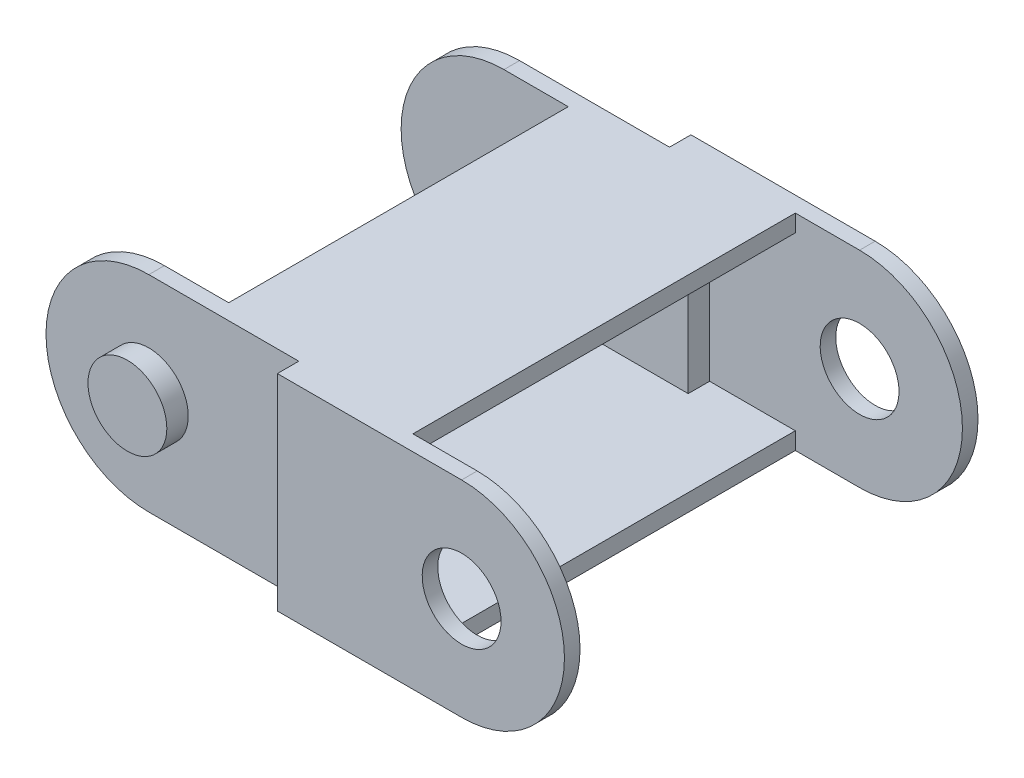
ISO-10303-21;
HEADER;
FILE_DESCRIPTION(('STEP AP214'),'2;1');
FILE_NAME('part.step','',(''),(''),'','','');
FILE_SCHEMA(('AUTOMOTIVE_DESIGN { 1 0 10303 214 1 1 1 1 }'));
ENDSEC;
DATA;
#1=APPLICATION_CONTEXT('core data for automotive mechanical design processes');
#2=APPLICATION_PROTOCOL_DEFINITION('international standard','automotive_design',2000,#1);
#3=PRODUCT_CONTEXT('',#1,'mechanical');
#4=PRODUCT('Part','Part','',(#3));
#5=PRODUCT_RELATED_PRODUCT_CATEGORY('part','',(#4));
#6=PRODUCT_DEFINITION_FORMATION('','',#4);
#7=PRODUCT_DEFINITION_CONTEXT('part definition',#1,'design');
#8=PRODUCT_DEFINITION('design','',#6,#7);
#9=PRODUCT_DEFINITION_SHAPE('','',#8);
#10=(LENGTH_UNIT() NAMED_UNIT(*) SI_UNIT(.MILLI.,.METRE.));
#11=(NAMED_UNIT(*) PLANE_ANGLE_UNIT() SI_UNIT($,.RADIAN.));
#12=(NAMED_UNIT(*) SI_UNIT($,.STERADIAN.) SOLID_ANGLE_UNIT());
#13=UNCERTAINTY_MEASURE_WITH_UNIT(LENGTH_MEASURE(1.E-05),#10,'distance_accuracy_value','');
#14=(GEOMETRIC_REPRESENTATION_CONTEXT(3) GLOBAL_UNCERTAINTY_ASSIGNED_CONTEXT((#13)) GLOBAL_UNIT_ASSIGNED_CONTEXT((#10,
#11,#12)) REPRESENTATION_CONTEXT('',''));
#15=CARTESIAN_POINT('',(0.,0.,0.));
#16=DIRECTION('',(0.,0.,1.));
#17=DIRECTION('',(1.,0.,0.));
#18=AXIS2_PLACEMENT_3D('',#15,#16,#17);
#19=CARTESIAN_POINT('',(-3.74999999999999,6.00000000000001,11.156));
#20=DIRECTION('',(-1.,0.,0.));
#21=DIRECTION('',(0.,0.,1.));
#22=AXIS2_PLACEMENT_3D('',#19,#20,#21);
#23=PLANE('',#22);
#24=DIRECTION('',(0.,0.,-1.));
#25=VECTOR('',#24,1.);
#26=CARTESIAN_POINT('',(-3.75,-5.,9.90600000000001));
#27=LINE('',#26,#25);
#28=CARTESIAN_POINT('',(-3.74999999999999,-5.00000000000003,11.156));
#29=VERTEX_POINT('',#28);
#30=CARTESIAN_POINT('',(-3.75,-5.,-11.156));
#31=VERTEX_POINT('',#30);
#32=EDGE_CURVE('E405',#29,#31,#27,.T.);
#33=ORIENTED_EDGE('',*,*,#32,.F.);
#34=DIRECTION('',(0.,-1.,0.));
#35=VECTOR('',#34,1.);
#36=CARTESIAN_POINT('',(-3.74999999999999,6.00000000000001,11.156));
#37=LINE('',#36,#35);
#38=CARTESIAN_POINT('',(-3.75,-6.00000000000001,11.156));
#39=VERTEX_POINT('',#38);
#40=EDGE_CURVE('E261',#29,#39,#37,.T.);
#41=ORIENTED_EDGE('',*,*,#40,.T.);
#42=DIRECTION('',(0.,0.,-1.));
#43=VECTOR('',#42,1.);
#44=CARTESIAN_POINT('',(-3.75,-6.00000000000001,11.156));
#45=LINE('',#44,#43);
#46=CARTESIAN_POINT('',(-3.75,-6.00000000000001,-11.156));
#47=VERTEX_POINT('',#46);
#48=EDGE_CURVE('E248',#39,#47,#45,.T.);
#49=ORIENTED_EDGE('',*,*,#48,.T.);
#50=DIRECTION('',(0.,-1.,0.));
#51=VECTOR('',#50,1.);
#52=CARTESIAN_POINT('',(-3.74999999999999,6.00000000000001,-11.156));
#53=LINE('',#52,#51);
#54=EDGE_CURVE('E247',#31,#47,#53,.T.);
#55=ORIENTED_EDGE('',*,*,#54,.F.);
#56=EDGE_LOOP('',(#33,#41,#49,#55));
#57=FACE_BOUND('',#56,.T.);
#58=ADVANCED_FACE('F32',(#57),#23,.F.);
#59=CARTESIAN_POINT('',(-25.5,6.00000000000001,-9.906));
#60=DIRECTION('',(0.,0.,-1.));
#61=DIRECTION('',(-1.,0.,0.));
#62=AXIS2_PLACEMENT_3D('',#59,#60,#61);
#63=PLANE('',#62);
#64=DIRECTION('',(0.,-1.,0.));
#65=VECTOR('',#64,1.);
#66=CARTESIAN_POINT('',(-8.75000000000001,5.,-9.90599999999998));
#67=LINE('',#66,#65);
#68=CARTESIAN_POINT('',(-8.75000000000001,5.,-9.90599999999998));
#69=VERTEX_POINT('',#68);
#70=CARTESIAN_POINT('',(-8.74999999999999,-5.00000000000002,-9.906));
#71=VERTEX_POINT('',#70);
#72=EDGE_CURVE('E47',#69,#71,#67,.T.);
#73=ORIENTED_EDGE('',*,*,#72,.F.);
#74=DIRECTION('',(1.,0.,0.));
#75=VECTOR('',#74,1.);
#76=CARTESIAN_POINT('',(-25.5,5.,-9.90599999999998));
#77=LINE('',#76,#75);
#78=CARTESIAN_POINT('',(-15.75,5.,-9.90599999999998));
#79=VERTEX_POINT('',#78);
#80=EDGE_CURVE('E221',#79,#69,#77,.T.);
#81=ORIENTED_EDGE('',*,*,#80,.F.);
#82=DIRECTION('',(0.,-1.,0.));
#83=VECTOR('',#82,1.);
#84=CARTESIAN_POINT('',(-15.75,6.00000000000001,-9.906));
#85=LINE('',#84,#83);
#86=CARTESIAN_POINT('',(-15.75,6.00000000000001,-9.906));
#87=VERTEX_POINT('',#86);
#88=EDGE_CURVE('E283',#87,#79,#85,.T.);
#89=ORIENTED_EDGE('',*,*,#88,.F.);
#90=DIRECTION('',(1.,0.,0.));
#91=VECTOR('',#90,1.);
#92=CARTESIAN_POINT('',(-25.5,6.00000000000001,-9.906));
#93=LINE('',#92,#91);
#94=CARTESIAN_POINT('',(-19.5,6.00000000000001,-9.906));
#95=VERTEX_POINT('',#94);
#96=EDGE_CURVE('E265',#95,#87,#93,.T.);
#97=ORIENTED_EDGE('',*,*,#96,.F.);
#98=CARTESIAN_POINT('',(-19.5,0.,-9.906));
#99=DIRECTION('',(0.,0.,-1.));
#100=DIRECTION('',(-1.,0.,0.));
#101=AXIS2_PLACEMENT_3D('',#98,#99,#100);
#102=CIRCLE('',#101,6.);
#103=CARTESIAN_POINT('',(-19.5,-5.99999999999999,-9.90599999999999));
#104=VERTEX_POINT('',#103);
#105=EDGE_CURVE('E323',#104,#95,#102,.T.);
#106=ORIENTED_EDGE('',*,*,#105,.F.);
#107=DIRECTION('',(-1.,0.,0.));
#108=VECTOR('',#107,1.);
#109=CARTESIAN_POINT('',(0.,-5.99999999999999,-9.906));
#110=LINE('',#109,#108);
#111=CARTESIAN_POINT('',(-15.75,-6.00000000000006,-9.906));
#112=VERTEX_POINT('',#111);
#113=EDGE_CURVE('E373',#112,#104,#110,.T.);
#114=ORIENTED_EDGE('',*,*,#113,.F.);
#115=CARTESIAN_POINT('',(-15.75,-5.,-9.906));
#116=VERTEX_POINT('',#115);
#117=EDGE_CURVE('E275',#116,#112,#85,.T.);
#118=ORIENTED_EDGE('',*,*,#117,.F.);
#119=DIRECTION('',(1.,0.,0.));
#120=VECTOR('',#119,1.);
#121=CARTESIAN_POINT('',(-25.5,-5.,-9.906));
#122=LINE('',#121,#120);
#123=EDGE_CURVE('E54',#116,#71,#122,.T.);
#124=ORIENTED_EDGE('',*,*,#123,.T.);
#125=EDGE_LOOP('',(#73,#81,#89,#97,#106,#114,#118,#124));
#126=FACE_BOUND('',#125,.T.);
#127=ADVANCED_FACE('F387',(#126),#63,.F.);
#128=CARTESIAN_POINT('',(-15.75,6.00000000000001,9.906));
#129=DIRECTION('',(1.,0.,0.));
#130=DIRECTION('',(0.,1.,0.));
#131=AXIS2_PLACEMENT_3D('',#128,#129,#130);
#132=PLANE('',#131);
#133=ORIENTED_EDGE('',*,*,#88,.T.);
#134=DIRECTION('',(0.,0.,1.));
#135=VECTOR('',#134,1.);
#136=CARTESIAN_POINT('',(-15.75,4.99999999999999,9.906));
#137=LINE('',#136,#135);
#138=CARTESIAN_POINT('',(-15.75,4.99999999999999,9.906));
#139=VERTEX_POINT('',#138);
#140=EDGE_CURVE('E11',#79,#139,#137,.T.);
#141=ORIENTED_EDGE('',*,*,#140,.T.);
#142=DIRECTION('',(0.,-1.,0.));
#143=VECTOR('',#142,1.);
#144=CARTESIAN_POINT('',(-15.75,6.00000000000001,9.906));
#145=LINE('',#144,#143);
#146=CARTESIAN_POINT('',(-15.75,6.00000000000001,9.906));
#147=VERTEX_POINT('',#146);
#148=EDGE_CURVE('E219',#147,#139,#145,.T.);
#149=ORIENTED_EDGE('',*,*,#148,.F.);
#150=DIRECTION('',(0.,0.,1.));
#151=VECTOR('',#150,1.);
#152=CARTESIAN_POINT('',(-15.75,6.00000000000001,9.906));
#153=LINE('',#152,#151);
#154=EDGE_CURVE('E268',#87,#147,#153,.T.);
#155=ORIENTED_EDGE('',*,*,#154,.F.);
#156=EDGE_LOOP('',(#133,#141,#149,#155));
#157=FACE_BOUND('',#156,.T.);
#158=ADVANCED_FACE('F473',(#157),#132,.F.);
#159=CARTESIAN_POINT('',(0.,0.,12.065));
#160=DIRECTION('',(0.,0.,-1.));
#161=DIRECTION('',(-1.,0.,0.));
#162=AXIS2_PLACEMENT_3D('',#159,#160,#161);
#163=CYLINDRICAL_SURFACE('',#162,6.);
#164=DIRECTION('',(0.,0.,-1.));
#165=VECTOR('',#164,1.);
#166=CARTESIAN_POINT('',(0.,-6.00000000000001,12.065));
#167=LINE('',#166,#165);
#168=CARTESIAN_POINT('',(0.,-6.00000000000001,12.065));
#169=VERTEX_POINT('',#168);
#170=CARTESIAN_POINT('',(0.,-6.00000000000001,11.156));
#171=VERTEX_POINT('',#170);
#172=EDGE_CURVE('E351',#169,#171,#167,.T.);
#173=ORIENTED_EDGE('',*,*,#172,.T.);
#174=CARTESIAN_POINT('',(0.,0.,11.156));
#175=DIRECTION('',(0.,0.,1.));
#176=DIRECTION('',(0.,-1.,0.));
#177=AXIS2_PLACEMENT_3D('',#174,#175,#176);
#178=CIRCLE('',#177,6.);
#179=CARTESIAN_POINT('',(0.,5.99999999999999,11.156));
#180=VERTEX_POINT('',#179);
#181=EDGE_CURVE('E317',#171,#180,#178,.T.);
#182=ORIENTED_EDGE('',*,*,#181,.T.);
#183=DIRECTION('',(0.,0.,-1.));
#184=VECTOR('',#183,1.);
#185=CARTESIAN_POINT('',(0.,5.99999999999999,12.065));
#186=LINE('',#185,#184);
#187=CARTESIAN_POINT('',(0.,5.99999999999999,12.065));
#188=VERTEX_POINT('',#187);
#189=EDGE_CURVE('E362',#188,#180,#186,.T.);
#190=ORIENTED_EDGE('',*,*,#189,.F.);
#191=CARTESIAN_POINT('',(0.,0.,12.065));
#192=DIRECTION('',(0.,0.,1.));
#193=DIRECTION('',(1.,0.,0.));
#194=AXIS2_PLACEMENT_3D('',#191,#192,#193);
#195=CIRCLE('',#194,6.);
#196=EDGE_CURVE('E334',#169,#188,#195,.T.);
#197=ORIENTED_EDGE('',*,*,#196,.F.);
#198=EDGE_LOOP('',(#173,#182,#190,#197));
#199=FACE_BOUND('',#198,.T.);
#200=ADVANCED_FACE('F436',(#199),#163,.T.);
#201=CARTESIAN_POINT('',(-19.5,0.,12.065));
#202=DIRECTION('',(0.,0.,-1.));
#203=DIRECTION('',(-1.,0.,0.));
#204=AXIS2_PLACEMENT_3D('',#201,#202,#203);
#205=CYLINDRICAL_SURFACE('',#204,6.);
#206=DIRECTION('',(0.,0.,-1.));
#207=VECTOR('',#206,1.);
#208=CARTESIAN_POINT('',(-19.5,5.99999999999998,12.065));
#209=LINE('',#208,#207);
#210=CARTESIAN_POINT('',(-19.5,6.00000000000001,10.815));
#211=VERTEX_POINT('',#210);
#212=CARTESIAN_POINT('',(-19.5,6.00000000000001,9.906));
#213=VERTEX_POINT('',#212);
#214=EDGE_CURVE('E361',#211,#213,#209,.T.);
#215=ORIENTED_EDGE('',*,*,#214,.T.);
#216=CARTESIAN_POINT('',(-19.5,0.,9.906));
#217=DIRECTION('',(0.,0.,1.));
#218=DIRECTION('',(1.,0.,0.));
#219=AXIS2_PLACEMENT_3D('',#216,#217,#218);
#220=CIRCLE('',#219,6.);
#221=CARTESIAN_POINT('',(-19.5,-5.99999999999999,9.906));
#222=VERTEX_POINT('',#221);
#223=EDGE_CURVE('E325',#213,#222,#220,.T.);
#224=ORIENTED_EDGE('',*,*,#223,.T.);
#225=DIRECTION('',(0.,0.,-1.));
#226=VECTOR('',#225,1.);
#227=CARTESIAN_POINT('',(-19.5,-5.99999999999999,12.065));
#228=LINE('',#227,#226);
#229=CARTESIAN_POINT('',(-19.5,-5.99999999999999,10.815));
#230=VERTEX_POINT('',#229);
#231=EDGE_CURVE('E357',#230,#222,#228,.T.);
#232=ORIENTED_EDGE('',*,*,#231,.F.);
#233=CARTESIAN_POINT('',(-19.5,0.,10.815));
#234=DIRECTION('',(0.,0.,-1.));
#235=DIRECTION('',(-1.,0.,0.));
#236=AXIS2_PLACEMENT_3D('',#233,#234,#235);
#237=CIRCLE('',#236,6.);
#238=EDGE_CURVE('E319',#230,#211,#237,.T.);
#239=ORIENTED_EDGE('',*,*,#238,.T.);
#240=EDGE_LOOP('',(#215,#224,#232,#239));
#241=FACE_BOUND('',#240,.T.);
#242=ADVANCED_FACE('F450',(#241),#205,.T.);
#243=CARTESIAN_POINT('',(0.,0.,12.065));
#244=DIRECTION('',(0.,0.,-1.));
#245=DIRECTION('',(-1.,0.,0.));
#246=AXIS2_PLACEMENT_3D('',#243,#244,#245);
#247=CYLINDRICAL_SURFACE('',#246,2.2999954);
#248=CARTESIAN_POINT('',(0.,0.,11.156));
#249=DIRECTION('',(0.,0.,1.));
#250=DIRECTION('',(0.,-1.,0.));
#251=AXIS2_PLACEMENT_3D('',#248,#249,#250);
#252=CIRCLE('',#251,2.2999954);
#253=CARTESIAN_POINT('',(0.,-2.2999954,11.156));
#254=VERTEX_POINT('',#253);
#255=EDGE_CURVE('E316',#254,#254,#252,.T.);
#256=ORIENTED_EDGE('',*,*,#255,.F.);
#257=EDGE_LOOP('',(#256));
#258=FACE_BOUND('',#257,.T.);
#259=CARTESIAN_POINT('',(0.,0.,12.065));
#260=DIRECTION('',(0.,0.,1.));
#261=DIRECTION('',(1.,0.,0.));
#262=AXIS2_PLACEMENT_3D('',#259,#260,#261);
#263=CIRCLE('',#262,2.2999954);
#264=CARTESIAN_POINT('',(2.2999954,0.,12.065));
#265=VERTEX_POINT('',#264);
#266=EDGE_CURVE('E328',#265,#265,#263,.T.);
#267=ORIENTED_EDGE('',*,*,#266,.T.);
#268=EDGE_LOOP('',(#267));
#269=FACE_BOUND('',#268,.T.);
#270=ADVANCED_FACE('F620',(#258,#269),#247,.F.);
#271=CARTESIAN_POINT('',(0.,0.,12.065));
#272=DIRECTION('',(0.,0.,1.));
#273=DIRECTION('',(1.,0.,0.));
#274=AXIS2_PLACEMENT_3D('',#271,#272,#273);
#275=PLANE('',#274);
#276=DIRECTION('',(0.,-1.,0.));
#277=VECTOR('',#276,1.);
#278=CARTESIAN_POINT('',(-10.75,6.00000000000001,12.065));
#279=LINE('',#278,#277);
#280=CARTESIAN_POINT('',(-10.75,6.00000000000001,12.065));
#281=VERTEX_POINT('',#280);
#282=CARTESIAN_POINT('',(-10.75,-6.00000000000001,12.065));
#283=VERTEX_POINT('',#282);
#284=EDGE_CURVE('E293',#281,#283,#279,.T.);
#285=ORIENTED_EDGE('',*,*,#284,.T.);
#286=DIRECTION('',(1.,0.,0.));
#287=VECTOR('',#286,1.);
#288=CARTESIAN_POINT('',(0.,-6.00000000000001,12.065));
#289=LINE('',#288,#287);
#290=EDGE_CURVE('E341',#283,#169,#289,.T.);
#291=ORIENTED_EDGE('',*,*,#290,.T.);
#292=ORIENTED_EDGE('',*,*,#196,.T.);
#293=DIRECTION('',(-1.,0.,0.));
#294=VECTOR('',#293,1.);
#295=CARTESIAN_POINT('',(0.,5.99999999999999,12.065));
#296=LINE('',#295,#294);
#297=EDGE_CURVE('E337',#188,#281,#296,.T.);
#298=ORIENTED_EDGE('',*,*,#297,.T.);
#299=EDGE_LOOP('',(#285,#291,#292,#298));
#300=FACE_BOUND('',#299,.T.);
#301=ORIENTED_EDGE('',*,*,#266,.F.);
#302=EDGE_LOOP('',(#301));
#303=FACE_BOUND('',#302,.T.);
#304=ADVANCED_FACE('F438',(#300,#303),#275,.T.);
#305=CARTESIAN_POINT('',(0.,0.,-12.065));
#306=DIRECTION('',(0.,0.,1.));
#307=DIRECTION('',(1.,0.,0.));
#308=AXIS2_PLACEMENT_3D('',#305,#306,#307);
#309=PLANE('',#308);
#310=DIRECTION('',(1.,0.,0.));
#311=VECTOR('',#310,1.);
#312=CARTESIAN_POINT('',(0.,-6.00000000000001,-12.065));
#313=LINE('',#312,#311);
#314=CARTESIAN_POINT('',(-10.75,-6.00000000000001,-12.065));
#315=VERTEX_POINT('',#314);
#316=CARTESIAN_POINT('',(0.,-6.00000000000001,-12.065));
#317=VERTEX_POINT('',#316);
#318=EDGE_CURVE('E338',#315,#317,#313,.T.);
#319=ORIENTED_EDGE('',*,*,#318,.F.);
#320=DIRECTION('',(0.,-1.,0.));
#321=VECTOR('',#320,1.);
#322=CARTESIAN_POINT('',(-10.75,6.00000000000001,-12.065));
#323=LINE('',#322,#321);
#324=CARTESIAN_POINT('',(-10.75,6.00000000000001,-12.065));
#325=VERTEX_POINT('',#324);
#326=EDGE_CURVE('E307',#325,#315,#323,.T.);
#327=ORIENTED_EDGE('',*,*,#326,.F.);
#328=DIRECTION('',(-1.,0.,0.));
#329=VECTOR('',#328,1.);
#330=CARTESIAN_POINT('',(0.,5.99999999999999,-12.065));
#331=LINE('',#330,#329);
#332=CARTESIAN_POINT('',(0.,5.99999999999999,-12.065));
#333=VERTEX_POINT('',#332);
#334=EDGE_CURVE('E346',#333,#325,#331,.T.);
#335=ORIENTED_EDGE('',*,*,#334,.F.);
#336=CARTESIAN_POINT('',(0.,0.,-12.065));
#337=DIRECTION('',(0.,0.,1.));
#338=DIRECTION('',(1.,0.,0.));
#339=AXIS2_PLACEMENT_3D('',#336,#337,#338);
#340=CIRCLE('',#339,6.);
#341=EDGE_CURVE('E331',#317,#333,#340,.T.);
#342=ORIENTED_EDGE('',*,*,#341,.F.);
#343=EDGE_LOOP('',(#319,#327,#335,#342));
#344=FACE_BOUND('',#343,.T.);
#345=CARTESIAN_POINT('',(0.,0.,-12.065));
#346=DIRECTION('',(0.,0.,1.));
#347=DIRECTION('',(1.,0.,0.));
#348=AXIS2_PLACEMENT_3D('',#345,#346,#347);
#349=CIRCLE('',#348,2.2999954);
#350=CARTESIAN_POINT('',(2.2999954,0.,-12.065));
#351=VERTEX_POINT('',#350);
#352=EDGE_CURVE('E327',#351,#351,#349,.T.);
#353=ORIENTED_EDGE('',*,*,#352,.T.);
#354=EDGE_LOOP('',(#353));
#355=FACE_BOUND('',#354,.T.);
#356=ADVANCED_FACE('F458',(#344,#355),#309,.F.);
#357=CARTESIAN_POINT('',(0.,5.99999999999999,-11.156));
#358=VERTEX_POINT('',#357);
#359=EDGE_CURVE('E366',#358,#333,#186,.T.);
#360=ORIENTED_EDGE('',*,*,#359,.F.);
#361=CARTESIAN_POINT('',(0.,0.,-11.156));
#362=DIRECTION('',(0.,0.,-1.));
#363=DIRECTION('',(0.,1.,0.));
#364=AXIS2_PLACEMENT_3D('',#361,#362,#363);
#365=CIRCLE('',#364,6.);
#366=CARTESIAN_POINT('',(0.,-6.00000000000001,-11.156));
#367=VERTEX_POINT('',#366);
#368=EDGE_CURVE('E314',#358,#367,#365,.T.);
#369=ORIENTED_EDGE('',*,*,#368,.T.);
#370=EDGE_CURVE('E343',#367,#317,#167,.T.);
#371=ORIENTED_EDGE('',*,*,#370,.T.);
#372=ORIENTED_EDGE('',*,*,#341,.T.);
#373=EDGE_LOOP('',(#360,#369,#371,#372));
#374=FACE_BOUND('',#373,.T.);
#375=ADVANCED_FACE('F34',(#374),#163,.T.);
#376=CARTESIAN_POINT('',(0.,5.99999999999999,12.065));
#377=DIRECTION('',(0.,-1.,0.));
#378=DIRECTION('',(1.,0.,0.));
#379=AXIS2_PLACEMENT_3D('',#376,#377,#378);
#380=PLANE('',#379);
#381=ORIENTED_EDGE('',*,*,#189,.T.);
#382=DIRECTION('',(-1.,0.,0.));
#383=VECTOR('',#382,1.);
#384=CARTESIAN_POINT('',(-3.74999999999999,6.00000000000001,11.156));
#385=LINE('',#384,#383);
#386=CARTESIAN_POINT('',(-3.74999999999999,6.00000000000001,11.156));
#387=VERTEX_POINT('',#386);
#388=EDGE_CURVE('E244',#180,#387,#385,.T.);
#389=ORIENTED_EDGE('',*,*,#388,.T.);
#390=DIRECTION('',(0.,0.,-1.));
#391=VECTOR('',#390,1.);
#392=CARTESIAN_POINT('',(-3.74999999999999,6.00000000000001,11.156));
#393=LINE('',#392,#391);
#394=CARTESIAN_POINT('',(-3.74999999999999,6.00000000000001,-11.156));
#395=VERTEX_POINT('',#394);
#396=EDGE_CURVE('E237',#387,#395,#393,.T.);
#397=ORIENTED_EDGE('',*,*,#396,.T.);
#398=DIRECTION('',(1.,0.,0.));
#399=VECTOR('',#398,1.);
#400=CARTESIAN_POINT('',(-3.74999999999999,6.00000000000001,-11.156));
#401=LINE('',#400,#399);
#402=EDGE_CURVE('E240',#395,#358,#401,.T.);
#403=ORIENTED_EDGE('',*,*,#402,.T.);
#404=ORIENTED_EDGE('',*,*,#359,.T.);
#405=ORIENTED_EDGE('',*,*,#334,.T.);
#406=DIRECTION('',(0.,0.,1.));
#407=VECTOR('',#406,1.);
#408=CARTESIAN_POINT('',(-10.75,6.00000000000001,-10.815));
#409=LINE('',#408,#407);
#410=CARTESIAN_POINT('',(-10.75,6.00000000000001,-10.815));
#411=VERTEX_POINT('',#410);
#412=EDGE_CURVE('E300',#325,#411,#409,.T.);
#413=ORIENTED_EDGE('',*,*,#412,.T.);
#414=DIRECTION('',(-1.,0.,0.));
#415=VECTOR('',#414,1.);
#416=CARTESIAN_POINT('',(-25.5,6.00000000000001,-10.815));
#417=LINE('',#416,#415);
#418=CARTESIAN_POINT('',(-19.5,6.00000000000001,-10.815));
#419=VERTEX_POINT('',#418);
#420=EDGE_CURVE('E303',#411,#419,#417,.T.);
#421=ORIENTED_EDGE('',*,*,#420,.T.);
#422=EDGE_CURVE('E358',#95,#419,#209,.T.);
#423=ORIENTED_EDGE('',*,*,#422,.F.);
#424=ORIENTED_EDGE('',*,*,#96,.T.);
#425=ORIENTED_EDGE('',*,*,#154,.T.);
#426=DIRECTION('',(-1.,0.,0.));
#427=VECTOR('',#426,1.);
#428=CARTESIAN_POINT('',(-25.5,6.00000000000001,9.906));
#429=LINE('',#428,#427);
#430=EDGE_CURVE('E272',#147,#213,#429,.T.);
#431=ORIENTED_EDGE('',*,*,#430,.T.);
#432=ORIENTED_EDGE('',*,*,#214,.F.);
#433=DIRECTION('',(1.,0.,0.));
#434=VECTOR('',#433,1.);
#435=CARTESIAN_POINT('',(-10.75,6.00000000000001,10.815));
#436=LINE('',#435,#434);
#437=CARTESIAN_POINT('',(-10.75,6.00000000000001,10.815));
#438=VERTEX_POINT('',#437);
#439=EDGE_CURVE('E289',#211,#438,#436,.T.);
#440=ORIENTED_EDGE('',*,*,#439,.T.);
#441=DIRECTION('',(0.,0.,1.));
#442=VECTOR('',#441,1.);
#443=CARTESIAN_POINT('',(-10.75,6.00000000000001,12.065));
#444=LINE('',#443,#442);
#445=EDGE_CURVE('E286',#438,#281,#444,.T.);
#446=ORIENTED_EDGE('',*,*,#445,.T.);
#447=ORIENTED_EDGE('',*,*,#297,.F.);
#448=EDGE_LOOP('',(#381,#389,#397,#403,#404,#405,#413,#421,#423,#424,#425,#431,#432,#440,#446,#447));
#449=FACE_BOUND('',#448,.T.);
#450=ADVANCED_FACE('F428',(#449),#380,.F.);
#451=ORIENTED_EDGE('',*,*,#105,.T.);
#452=ORIENTED_EDGE('',*,*,#422,.T.);
#453=CARTESIAN_POINT('',(-19.5,0.,-10.815));
#454=DIRECTION('',(0.,0.,1.));
#455=DIRECTION('',(1.,0.,0.));
#456=AXIS2_PLACEMENT_3D('',#453,#454,#455);
#457=CIRCLE('',#456,6.);
#458=CARTESIAN_POINT('',(-19.5,-5.99999999999999,-10.815));
#459=VERTEX_POINT('',#458);
#460=EDGE_CURVE('E321',#419,#459,#457,.T.);
#461=ORIENTED_EDGE('',*,*,#460,.T.);
#462=EDGE_CURVE('E354',#104,#459,#228,.T.);
#463=ORIENTED_EDGE('',*,*,#462,.F.);
#464=EDGE_LOOP('',(#451,#452,#461,#463));
#465=FACE_BOUND('',#464,.T.);
#466=ADVANCED_FACE('F469',(#465),#205,.T.);
#467=CARTESIAN_POINT('',(0.,-6.00000000000001,12.065));
#468=DIRECTION('',(0.,1.,0.));
#469=DIRECTION('',(-1.,0.,0.));
#470=AXIS2_PLACEMENT_3D('',#467,#468,#469);
#471=PLANE('',#470);
#472=ORIENTED_EDGE('',*,*,#48,.F.);
#473=DIRECTION('',(-1.,0.,0.));
#474=VECTOR('',#473,1.);
#475=CARTESIAN_POINT('',(-3.75,-6.00000000000001,11.156));
#476=LINE('',#475,#474);
#477=EDGE_CURVE('E241',#171,#39,#476,.T.);
#478=ORIENTED_EDGE('',*,*,#477,.F.);
#479=ORIENTED_EDGE('',*,*,#172,.F.);
#480=ORIENTED_EDGE('',*,*,#290,.F.);
#481=DIRECTION('',(0.,0.,1.));
#482=VECTOR('',#481,1.);
#483=CARTESIAN_POINT('',(-10.75,-6.00000000000001,12.065));
#484=LINE('',#483,#482);
#485=CARTESIAN_POINT('',(-10.75,-6.00000000000001,10.815));
#486=VERTEX_POINT('',#485);
#487=EDGE_CURVE('E290',#486,#283,#484,.T.);
#488=ORIENTED_EDGE('',*,*,#487,.F.);
#489=DIRECTION('',(-1.,0.,0.));
#490=VECTOR('',#489,1.);
#491=CARTESIAN_POINT('',(0.,-6.00000000000001,10.815));
#492=LINE('',#491,#490);
#493=EDGE_CURVE('E365',#486,#230,#492,.T.);
#494=ORIENTED_EDGE('',*,*,#493,.T.);
#495=ORIENTED_EDGE('',*,*,#231,.T.);
#496=DIRECTION('',(-1.,0.,0.));
#497=VECTOR('',#496,1.);
#498=CARTESIAN_POINT('',(-25.5,-6.00000000000001,9.906));
#499=LINE('',#498,#497);
#500=CARTESIAN_POINT('',(-15.75,-6.00000000000006,9.906));
#501=VERTEX_POINT('',#500);
#502=EDGE_CURVE('E269',#501,#222,#499,.T.);
#503=ORIENTED_EDGE('',*,*,#502,.F.);
#504=DIRECTION('',(0.,0.,1.));
#505=VECTOR('',#504,1.);
#506=CARTESIAN_POINT('',(-15.75,-6.00000000000006,9.906));
#507=LINE('',#506,#505);
#508=EDGE_CURVE('E236',#112,#501,#507,.T.);
#509=ORIENTED_EDGE('',*,*,#508,.F.);
#510=ORIENTED_EDGE('',*,*,#113,.T.);
#511=ORIENTED_EDGE('',*,*,#462,.T.);
#512=DIRECTION('',(-1.,0.,0.));
#513=VECTOR('',#512,1.);
#514=CARTESIAN_POINT('',(-25.5,-6.00000000000001,-10.815));
#515=LINE('',#514,#513);
#516=CARTESIAN_POINT('',(-10.75,-6.00000000000001,-10.815));
#517=VERTEX_POINT('',#516);
#518=EDGE_CURVE('E304',#517,#459,#515,.T.);
#519=ORIENTED_EDGE('',*,*,#518,.F.);
#520=DIRECTION('',(0.,0.,1.));
#521=VECTOR('',#520,1.);
#522=CARTESIAN_POINT('',(-10.75,-6.00000000000001,-10.815));
#523=LINE('',#522,#521);
#524=EDGE_CURVE('E281',#315,#517,#523,.T.);
#525=ORIENTED_EDGE('',*,*,#524,.F.);
#526=ORIENTED_EDGE('',*,*,#318,.T.);
#527=ORIENTED_EDGE('',*,*,#370,.F.);
#528=DIRECTION('',(1.,0.,0.));
#529=VECTOR('',#528,1.);
#530=CARTESIAN_POINT('',(-3.75,-6.00000000000001,-11.156));
#531=LINE('',#530,#529);
#532=EDGE_CURVE('E251',#47,#367,#531,.T.);
#533=ORIENTED_EDGE('',*,*,#532,.F.);
#534=EDGE_LOOP('',(#472,#478,#479,#480,#488,#494,#495,#503,#509,#510,#511,#519,#525,#526,#527,#533));
#535=FACE_BOUND('',#534,.T.);
#536=ADVANCED_FACE('F394',(#535),#471,.F.);
#537=CARTESIAN_POINT('',(0.,0.,-11.156));
#538=DIRECTION('',(0.,0.,-1.));
#539=DIRECTION('',(0.,1.,0.));
#540=AXIS2_PLACEMENT_3D('',#537,#538,#539);
#541=CIRCLE('',#540,2.2999954);
#542=CARTESIAN_POINT('',(0.,2.2999954,-11.156));
#543=VERTEX_POINT('',#542);
#544=EDGE_CURVE('E260',#543,#543,#541,.T.);
#545=ORIENTED_EDGE('',*,*,#544,.F.);
#546=EDGE_LOOP('',(#545));
#547=FACE_BOUND('',#546,.T.);
#548=ORIENTED_EDGE('',*,*,#352,.F.);
#549=EDGE_LOOP('',(#548));
#550=FACE_BOUND('',#549,.T.);
#551=ADVANCED_FACE('F499',(#547,#550),#247,.F.);
#552=CARTESIAN_POINT('',(-3.74999999999999,6.00000000000001,11.156));
#553=DIRECTION('',(0.,0.,1.));
#554=DIRECTION('',(0.,-1.,0.));
#555=AXIS2_PLACEMENT_3D('',#552,#553,#554);
#556=PLANE('',#555);
#557=ORIENTED_EDGE('',*,*,#255,.T.);
#558=EDGE_LOOP('',(#557));
#559=FACE_BOUND('',#558,.T.);
#560=ORIENTED_EDGE('',*,*,#477,.T.);
#561=ORIENTED_EDGE('',*,*,#40,.F.);
#562=DIRECTION('',(1.,0.,0.));
#563=VECTOR('',#562,1.);
#564=CARTESIAN_POINT('',(-8.74999999999999,-5.00000000000002,11.156));
#565=LINE('',#564,#563);
#566=CARTESIAN_POINT('',(-8.74999999999999,-5.00000000000002,11.156));
#567=VERTEX_POINT('',#566);
#568=EDGE_CURVE('E399',#567,#29,#565,.T.);
#569=ORIENTED_EDGE('',*,*,#568,.F.);
#570=DIRECTION('',(0.,-1.,0.));
#571=VECTOR('',#570,1.);
#572=CARTESIAN_POINT('',(-8.74999999999999,5.,11.156));
#573=LINE('',#572,#571);
#574=CARTESIAN_POINT('',(-8.74999999999999,5.,11.156));
#575=VERTEX_POINT('',#574);
#576=EDGE_CURVE('E204',#575,#567,#573,.T.);
#577=ORIENTED_EDGE('',*,*,#576,.F.);
#578=DIRECTION('',(1.,0.,0.));
#579=VECTOR('',#578,1.);
#580=CARTESIAN_POINT('',(-8.74999999999999,5.,11.156));
#581=LINE('',#580,#579);
#582=CARTESIAN_POINT('',(-3.74999999999999,5.,11.156));
#583=VERTEX_POINT('',#582);
#584=EDGE_CURVE('E200',#575,#583,#581,.T.);
#585=ORIENTED_EDGE('',*,*,#584,.T.);
#586=EDGE_CURVE('E257',#387,#583,#37,.T.);
#587=ORIENTED_EDGE('',*,*,#586,.F.);
#588=ORIENTED_EDGE('',*,*,#388,.F.);
#589=ORIENTED_EDGE('',*,*,#181,.F.);
#590=EDGE_LOOP('',(#560,#561,#569,#577,#585,#587,#588,#589));
#591=FACE_BOUND('',#590,.T.);
#592=ADVANCED_FACE('F422',(#559,#591),#556,.F.);
#593=CARTESIAN_POINT('',(-3.74999999999999,6.00000000000001,-11.156));
#594=DIRECTION('',(0.,0.,-1.));
#595=DIRECTION('',(0.,1.,0.));
#596=AXIS2_PLACEMENT_3D('',#593,#594,#595);
#597=PLANE('',#596);
#598=ORIENTED_EDGE('',*,*,#544,.T.);
#599=EDGE_LOOP('',(#598));
#600=FACE_BOUND('',#599,.T.);
#601=ORIENTED_EDGE('',*,*,#402,.F.);
#602=CARTESIAN_POINT('',(-3.74999999999999,5.,-11.156));
#603=VERTEX_POINT('',#602);
#604=EDGE_CURVE('E262',#395,#603,#53,.T.);
#605=ORIENTED_EDGE('',*,*,#604,.T.);
#606=DIRECTION('',(1.,0.,0.));
#607=VECTOR('',#606,1.);
#608=CARTESIAN_POINT('',(-8.75000000000001,5.,-11.156));
#609=LINE('',#608,#607);
#610=CARTESIAN_POINT('',(-8.75000000000001,5.,-11.156));
#611=VERTEX_POINT('',#610);
#612=EDGE_CURVE('E214',#611,#603,#609,.T.);
#613=ORIENTED_EDGE('',*,*,#612,.F.);
#614=DIRECTION('',(0.,1.,0.));
#615=VECTOR('',#614,1.);
#616=CARTESIAN_POINT('',(-8.75000000000001,5.,-11.156));
#617=LINE('',#616,#615);
#618=CARTESIAN_POINT('',(-8.74999999999999,-5.00000000000002,-11.156));
#619=VERTEX_POINT('',#618);
#620=EDGE_CURVE('E410',#619,#611,#617,.T.);
#621=ORIENTED_EDGE('',*,*,#620,.F.);
#622=DIRECTION('',(1.,0.,0.));
#623=VECTOR('',#622,1.);
#624=CARTESIAN_POINT('',(-8.74999999999999,-5.00000000000002,-11.156));
#625=LINE('',#624,#623);
#626=EDGE_CURVE('E415',#619,#31,#625,.T.);
#627=ORIENTED_EDGE('',*,*,#626,.T.);
#628=ORIENTED_EDGE('',*,*,#54,.T.);
#629=ORIENTED_EDGE('',*,*,#532,.T.);
#630=ORIENTED_EDGE('',*,*,#368,.F.);
#631=EDGE_LOOP('',(#601,#605,#613,#621,#627,#628,#629,#630));
#632=FACE_BOUND('',#631,.T.);
#633=ADVANCED_FACE('F477',(#600,#632),#597,.F.);
#634=ORIENTED_EDGE('',*,*,#586,.T.);
#635=DIRECTION('',(0.,0.,1.));
#636=VECTOR('',#635,1.);
#637=CARTESIAN_POINT('',(-3.74999999999999,5.,-9.90599999999998));
#638=LINE('',#637,#636);
#639=EDGE_CURVE('E228',#603,#583,#638,.T.);
#640=ORIENTED_EDGE('',*,*,#639,.F.);
#641=ORIENTED_EDGE('',*,*,#604,.F.);
#642=ORIENTED_EDGE('',*,*,#396,.F.);
#643=EDGE_LOOP('',(#634,#640,#641,#642));
#644=FACE_BOUND('',#643,.T.);
#645=ADVANCED_FACE('F425',(#644),#23,.F.);
#646=CARTESIAN_POINT('',(-10.75,6.00000000000001,10.815));
#647=DIRECTION('',(0.,0.,-1.));
#648=DIRECTION('',(-1.,0.,0.));
#649=AXIS2_PLACEMENT_3D('',#646,#647,#648);
#650=PLANE('',#649);
#651=CARTESIAN_POINT('',(-19.5,0.,10.815));
#652=DIRECTION('',(0.,0.,-1.));
#653=DIRECTION('',(-1.,0.,0.));
#654=AXIS2_PLACEMENT_3D('',#651,#652,#653);
#655=CIRCLE('',#654,2.2999954);
#656=CARTESIAN_POINT('',(-21.7999954,0.,10.815));
#657=VERTEX_POINT('',#656);
#658=EDGE_CURVE('E376',#657,#657,#655,.F.);
#659=ORIENTED_EDGE('',*,*,#658,.F.);
#660=EDGE_LOOP('',(#659));
#661=FACE_BOUND('',#660,.T.);
#662=ORIENTED_EDGE('',*,*,#238,.F.);
#663=ORIENTED_EDGE('',*,*,#493,.F.);
#664=DIRECTION('',(0.,-1.,0.));
#665=VECTOR('',#664,1.);
#666=CARTESIAN_POINT('',(-10.75,6.00000000000001,10.815));
#667=LINE('',#666,#665);
#668=EDGE_CURVE('E252',#438,#486,#667,.T.);
#669=ORIENTED_EDGE('',*,*,#668,.F.);
#670=ORIENTED_EDGE('',*,*,#439,.F.);
#671=EDGE_LOOP('',(#662,#663,#669,#670));
#672=FACE_BOUND('',#671,.T.);
#673=ADVANCED_FACE('F446',(#661,#672),#650,.F.);
#674=CARTESIAN_POINT('',(-10.75,6.00000000000001,12.065));
#675=DIRECTION('',(1.,0.,0.));
#676=DIRECTION('',(0.,0.,-1.));
#677=AXIS2_PLACEMENT_3D('',#674,#675,#676);
#678=PLANE('',#677);
#679=ORIENTED_EDGE('',*,*,#487,.T.);
#680=ORIENTED_EDGE('',*,*,#284,.F.);
#681=ORIENTED_EDGE('',*,*,#445,.F.);
#682=ORIENTED_EDGE('',*,*,#668,.T.);
#683=EDGE_LOOP('',(#679,#680,#681,#682));
#684=FACE_BOUND('',#683,.T.);
#685=ADVANCED_FACE('F442',(#684),#678,.F.);
#686=CARTESIAN_POINT('',(-25.5,6.00000000000001,-10.815));
#687=DIRECTION('',(0.,0.,1.));
#688=DIRECTION('',(1.,0.,0.));
#689=AXIS2_PLACEMENT_3D('',#686,#687,#688);
#690=PLANE('',#689);
#691=CARTESIAN_POINT('',(-19.5,0.,-10.815));
#692=DIRECTION('',(0.,0.,1.));
#693=DIRECTION('',(1.,0.,0.));
#694=AXIS2_PLACEMENT_3D('',#691,#692,#693);
#695=CIRCLE('',#694,2.2999954);
#696=CARTESIAN_POINT('',(-17.2000046,0.,-10.815));
#697=VERTEX_POINT('',#696);
#698=EDGE_CURVE('E379',#697,#697,#695,.F.);
#699=ORIENTED_EDGE('',*,*,#698,.F.);
#700=EDGE_LOOP('',(#699));
#701=FACE_BOUND('',#700,.T.);
#702=ORIENTED_EDGE('',*,*,#420,.F.);
#703=DIRECTION('',(0.,-1.,0.));
#704=VECTOR('',#703,1.);
#705=CARTESIAN_POINT('',(-10.75,6.00000000000001,-10.815));
#706=LINE('',#705,#704);
#707=EDGE_CURVE('E295',#411,#517,#706,.T.);
#708=ORIENTED_EDGE('',*,*,#707,.T.);
#709=ORIENTED_EDGE('',*,*,#518,.T.);
#710=ORIENTED_EDGE('',*,*,#460,.F.);
#711=EDGE_LOOP('',(#702,#708,#709,#710));
#712=FACE_BOUND('',#711,.T.);
#713=ADVANCED_FACE('F573',(#701,#712),#690,.F.);
#714=CARTESIAN_POINT('',(-10.75,6.00000000000001,-10.815));
#715=DIRECTION('',(1.,0.,0.));
#716=DIRECTION('',(0.,1.,0.));
#717=AXIS2_PLACEMENT_3D('',#714,#715,#716);
#718=PLANE('',#717);
#719=ORIENTED_EDGE('',*,*,#524,.T.);
#720=ORIENTED_EDGE('',*,*,#707,.F.);
#721=ORIENTED_EDGE('',*,*,#412,.F.);
#722=ORIENTED_EDGE('',*,*,#326,.T.);
#723=EDGE_LOOP('',(#719,#720,#721,#722));
#724=FACE_BOUND('',#723,.T.);
#725=ADVANCED_FACE('F464',(#724),#718,.F.);
#726=CARTESIAN_POINT('',(-25.5,6.00000000000001,9.906));
#727=DIRECTION('',(0.,0.,1.));
#728=DIRECTION('',(1.,0.,0.));
#729=AXIS2_PLACEMENT_3D('',#726,#727,#728);
#730=PLANE('',#729);
#731=DIRECTION('',(1.,0.,0.));
#732=VECTOR('',#731,1.);
#733=CARTESIAN_POINT('',(-25.5,5.,9.906));
#734=LINE('',#733,#732);
#735=CARTESIAN_POINT('',(-8.74999999999999,5.,9.90600000000001));
#736=VERTEX_POINT('',#735);
#737=EDGE_CURVE('E198',#139,#736,#734,.T.);
#738=ORIENTED_EDGE('',*,*,#737,.T.);
#739=DIRECTION('',(0.,1.,0.));
#740=VECTOR('',#739,1.);
#741=CARTESIAN_POINT('',(-8.74999999999999,5.,9.90600000000001));
#742=LINE('',#741,#740);
#743=CARTESIAN_POINT('',(-8.74999999999999,-5.00000000000002,9.906));
#744=VERTEX_POINT('',#743);
#745=EDGE_CURVE('E205',#744,#736,#742,.T.);
#746=ORIENTED_EDGE('',*,*,#745,.F.);
#747=DIRECTION('',(1.,0.,0.));
#748=VECTOR('',#747,1.);
#749=CARTESIAN_POINT('',(-25.5,-5.,9.90600000000001));
#750=LINE('',#749,#748);
#751=CARTESIAN_POINT('',(-15.75,-5.,9.90600000000001));
#752=VERTEX_POINT('',#751);
#753=EDGE_CURVE('E232',#752,#744,#750,.T.);
#754=ORIENTED_EDGE('',*,*,#753,.F.);
#755=EDGE_CURVE('E282',#752,#501,#145,.T.);
#756=ORIENTED_EDGE('',*,*,#755,.T.);
#757=ORIENTED_EDGE('',*,*,#502,.T.);
#758=ORIENTED_EDGE('',*,*,#223,.F.);
#759=ORIENTED_EDGE('',*,*,#430,.F.);
#760=ORIENTED_EDGE('',*,*,#148,.T.);
#761=EDGE_LOOP('',(#738,#746,#754,#756,#757,#758,#759,#760));
#762=FACE_BOUND('',#761,.T.);
#763=ADVANCED_FACE('F217',(#762),#730,.F.);
#764=ORIENTED_EDGE('',*,*,#755,.F.);
#765=DIRECTION('',(0.,0.,-1.));
#766=VECTOR('',#765,1.);
#767=CARTESIAN_POINT('',(-15.75,-5.,9.906));
#768=LINE('',#767,#766);
#769=EDGE_CURVE('E40',#752,#116,#768,.T.);
#770=ORIENTED_EDGE('',*,*,#769,.T.);
#771=ORIENTED_EDGE('',*,*,#117,.T.);
#772=ORIENTED_EDGE('',*,*,#508,.T.);
#773=EDGE_LOOP('',(#764,#770,#771,#772));
#774=FACE_BOUND('',#773,.T.);
#775=ADVANCED_FACE('F384',(#774),#132,.F.);
#776=CARTESIAN_POINT('',(-19.5,0.,18.5703693761515));
#777=DIRECTION('',(0.,0.,-1.));
#778=DIRECTION('',(-1.,0.,0.));
#779=AXIS2_PLACEMENT_3D('',#776,#777,#778);
#780=CYLINDRICAL_SURFACE('',#779,2.2999954);
#781=ORIENTED_EDGE('',*,*,#658,.T.);
#782=EDGE_LOOP('',(#781));
#783=FACE_BOUND('',#782,.T.);
#784=CARTESIAN_POINT('',(-19.5,0.,12.065));
#785=DIRECTION('',(0.,0.,1.));
#786=DIRECTION('',(1.,0.,0.));
#787=AXIS2_PLACEMENT_3D('',#784,#785,#786);
#788=CIRCLE('',#787,2.2999954);
#789=CARTESIAN_POINT('',(-17.2000046,0.,12.065));
#790=VERTEX_POINT('',#789);
#791=EDGE_CURVE('E224',#790,#790,#788,.T.);
#792=ORIENTED_EDGE('',*,*,#791,.F.);
#793=EDGE_LOOP('',(#792));
#794=FACE_BOUND('',#793,.T.);
#795=ADVANCED_FACE('F507',(#783,#794),#780,.T.);
#796=CARTESIAN_POINT('',(0.,0.,12.065));
#797=DIRECTION('',(0.,0.,1.));
#798=DIRECTION('',(1.,0.,0.));
#799=AXIS2_PLACEMENT_3D('',#796,#797,#798);
#800=PLANE('',#799);
#801=ORIENTED_EDGE('',*,*,#791,.T.);
#802=EDGE_LOOP('',(#801));
#803=FACE_BOUND('',#802,.T.);
#804=ADVANCED_FACE('F503',(#803),#800,.T.);
#805=CARTESIAN_POINT('',(-19.5,0.,-18.5703693761515));
#806=DIRECTION('',(0.,0.,1.));
#807=DIRECTION('',(0.,-1.,0.));
#808=AXIS2_PLACEMENT_3D('',#805,#806,#807);
#809=CYLINDRICAL_SURFACE('',#808,2.2999954);
#810=CARTESIAN_POINT('',(-19.5,0.,-12.065));
#811=DIRECTION('',(0.,0.,1.));
#812=DIRECTION('',(1.,0.,0.));
#813=AXIS2_PLACEMENT_3D('',#810,#811,#812);
#814=CIRCLE('',#813,2.2999954);
#815=CARTESIAN_POINT('',(-17.2000046,0.,-12.065));
#816=VERTEX_POINT('',#815);
#817=EDGE_CURVE('E220',#816,#816,#814,.T.);
#818=ORIENTED_EDGE('',*,*,#817,.T.);
#819=EDGE_LOOP('',(#818));
#820=FACE_BOUND('',#819,.T.);
#821=ORIENTED_EDGE('',*,*,#698,.T.);
#822=EDGE_LOOP('',(#821));
#823=FACE_BOUND('',#822,.T.);
#824=ADVANCED_FACE('F506',(#820,#823),#809,.T.);
#825=CARTESIAN_POINT('',(0.,0.,-12.065));
#826=DIRECTION('',(0.,0.,1.));
#827=DIRECTION('',(1.,0.,0.));
#828=AXIS2_PLACEMENT_3D('',#825,#826,#827);
#829=PLANE('',#828);
#830=ORIENTED_EDGE('',*,*,#817,.F.);
#831=EDGE_LOOP('',(#830));
#832=FACE_BOUND('',#831,.T.);
#833=ADVANCED_FACE('F514',(#832),#829,.F.);
#834=CARTESIAN_POINT('',(-25.5,5.,-9.90599999999998));
#835=DIRECTION('',(0.,1.,0.));
#836=DIRECTION('',(-1.,0.,0.));
#837=AXIS2_PLACEMENT_3D('',#834,#835,#836);
#838=PLANE('',#837);
#839=ORIENTED_EDGE('',*,*,#80,.T.);
#840=DIRECTION('',(0.,0.,1.));
#841=VECTOR('',#840,1.);
#842=CARTESIAN_POINT('',(-8.75000000000001,5.,-9.90599999999998));
#843=LINE('',#842,#841);
#844=EDGE_CURVE('E413',#611,#69,#843,.T.);
#845=ORIENTED_EDGE('',*,*,#844,.F.);
#846=ORIENTED_EDGE('',*,*,#612,.T.);
#847=ORIENTED_EDGE('',*,*,#639,.T.);
#848=ORIENTED_EDGE('',*,*,#584,.F.);
#849=DIRECTION('',(0.,0.,1.));
#850=VECTOR('',#849,1.);
#851=CARTESIAN_POINT('',(-8.74999999999999,5.,9.90600000000001));
#852=LINE('',#851,#850);
#853=EDGE_CURVE('E193',#736,#575,#852,.T.);
#854=ORIENTED_EDGE('',*,*,#853,.F.);
#855=ORIENTED_EDGE('',*,*,#737,.F.);
#856=ORIENTED_EDGE('',*,*,#140,.F.);
#857=EDGE_LOOP('',(#839,#845,#846,#847,#848,#854,#855,#856));
#858=FACE_BOUND('',#857,.T.);
#859=ADVANCED_FACE('F196',(#858),#838,.F.);
#860=CARTESIAN_POINT('',(-25.5,-5.,9.90600000000001));
#861=DIRECTION('',(0.,-1.,0.));
#862=DIRECTION('',(1.,0.,0.));
#863=AXIS2_PLACEMENT_3D('',#860,#861,#862);
#864=PLANE('',#863);
#865=ORIENTED_EDGE('',*,*,#753,.T.);
#866=DIRECTION('',(0.,0.,-1.));
#867=VECTOR('',#866,1.);
#868=CARTESIAN_POINT('',(-8.74999999999999,-5.00000000000002,9.906));
#869=LINE('',#868,#867);
#870=EDGE_CURVE('E210',#567,#744,#869,.T.);
#871=ORIENTED_EDGE('',*,*,#870,.F.);
#872=ORIENTED_EDGE('',*,*,#568,.T.);
#873=ORIENTED_EDGE('',*,*,#32,.T.);
#874=ORIENTED_EDGE('',*,*,#626,.F.);
#875=DIRECTION('',(0.,0.,-1.));
#876=VECTOR('',#875,1.);
#877=CARTESIAN_POINT('',(-8.74999999999999,-5.00000000000002,-9.90599999999998));
#878=LINE('',#877,#876);
#879=EDGE_CURVE('E408',#71,#619,#878,.T.);
#880=ORIENTED_EDGE('',*,*,#879,.F.);
#881=ORIENTED_EDGE('',*,*,#123,.F.);
#882=ORIENTED_EDGE('',*,*,#769,.F.);
#883=EDGE_LOOP('',(#865,#871,#872,#873,#874,#880,#881,#882));
#884=FACE_BOUND('',#883,.T.);
#885=ADVANCED_FACE('F397',(#884),#864,.F.);
#886=CARTESIAN_POINT('',(-8.74999999999999,0.,0.));
#887=DIRECTION('',(1.,0.,0.));
#888=DIRECTION('',(0.,0.,-1.));
#889=AXIS2_PLACEMENT_3D('',#886,#887,#888);
#890=PLANE('',#889);
#891=ORIENTED_EDGE('',*,*,#72,.T.);
#892=ORIENTED_EDGE('',*,*,#879,.T.);
#893=ORIENTED_EDGE('',*,*,#620,.T.);
#894=ORIENTED_EDGE('',*,*,#844,.T.);
#895=EDGE_LOOP('',(#891,#892,#893,#894));
#896=FACE_BOUND('',#895,.T.);
#897=ADVANCED_FACE('F474',(#896),#890,.T.);
#898=CARTESIAN_POINT('',(-8.74999999999999,0.,0.));
#899=DIRECTION('',(-1.,0.,0.));
#900=DIRECTION('',(0.,0.,1.));
#901=AXIS2_PLACEMENT_3D('',#898,#899,#900);
#902=PLANE('',#901);
#903=ORIENTED_EDGE('',*,*,#745,.T.);
#904=ORIENTED_EDGE('',*,*,#853,.T.);
#905=ORIENTED_EDGE('',*,*,#576,.T.);
#906=ORIENTED_EDGE('',*,*,#870,.T.);
#907=EDGE_LOOP('',(#903,#904,#905,#906));
#908=FACE_BOUND('',#907,.T.);
#909=ADVANCED_FACE('F208',(#908),#902,.F.);
#910=CLOSED_SHELL('',(#58,#127,#158,#200,#242,#270,#304,#356,#375,#450,#466,#536,#551,#592,#633,
#645,#673,#685,#713,#725,#763,#775,#795,#804,#824,#833,#859,#885,#897,#909));
#911=MANIFOLD_SOLID_BREP('B2',#910);
#912=ADVANCED_BREP_SHAPE_REPRESENTATION('',(#18,#911),#14);
#913=SHAPE_DEFINITION_REPRESENTATION(#9,#912);
ENDSEC;
END-ISO-10303-21;
